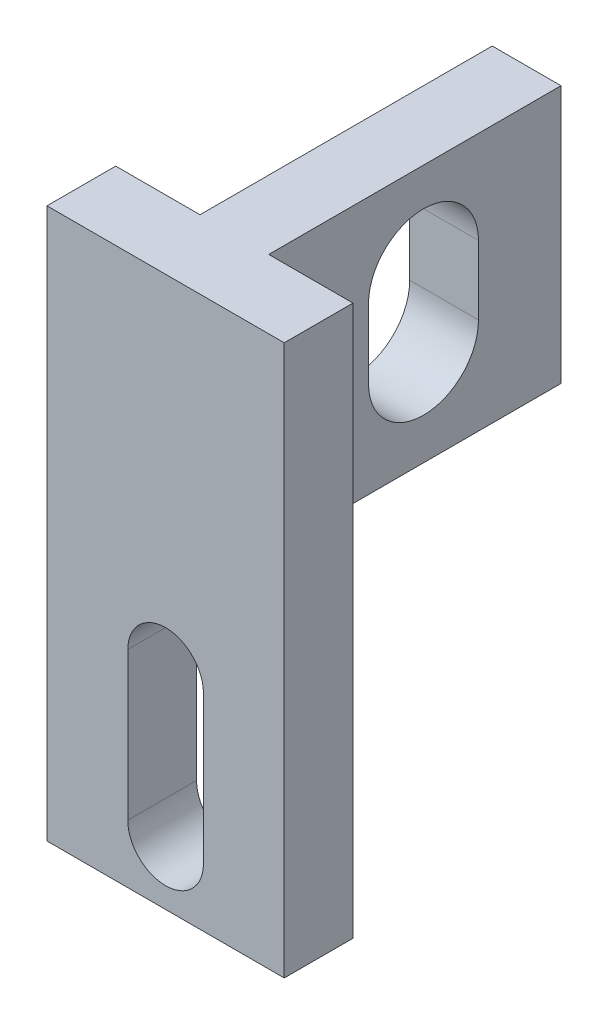
ISO-10303-21;
HEADER;
FILE_DESCRIPTION(('STEP AP214'),'2;1');
FILE_NAME('part.step','',(''),(''),'','','');
FILE_SCHEMA(('AUTOMOTIVE_DESIGN { 1 0 10303 214 1 1 1 1 }'));
ENDSEC;
DATA;
#1=APPLICATION_CONTEXT('core data for automotive mechanical design processes');
#2=APPLICATION_PROTOCOL_DEFINITION('international standard','automotive_design',2000,#1);
#3=PRODUCT_CONTEXT('',#1,'mechanical');
#4=PRODUCT('Part','Part','',(#3));
#5=PRODUCT_RELATED_PRODUCT_CATEGORY('part','',(#4));
#6=PRODUCT_DEFINITION_FORMATION('','',#4);
#7=PRODUCT_DEFINITION_CONTEXT('part definition',#1,'design');
#8=PRODUCT_DEFINITION('design','',#6,#7);
#9=PRODUCT_DEFINITION_SHAPE('','',#8);
#10=(LENGTH_UNIT() NAMED_UNIT(*) SI_UNIT(.MILLI.,.METRE.));
#11=(NAMED_UNIT(*) PLANE_ANGLE_UNIT() SI_UNIT($,.RADIAN.));
#12=(NAMED_UNIT(*) SI_UNIT($,.STERADIAN.) SOLID_ANGLE_UNIT());
#13=UNCERTAINTY_MEASURE_WITH_UNIT(LENGTH_MEASURE(1.E-05),#10,'distance_accuracy_value','');
#14=(GEOMETRIC_REPRESENTATION_CONTEXT(3) GLOBAL_UNCERTAINTY_ASSIGNED_CONTEXT((#13)) GLOBAL_UNIT_ASSIGNED_CONTEXT((#10,
#11,#12)) REPRESENTATION_CONTEXT('',''));
#15=CARTESIAN_POINT('',(0.,0.,0.));
#16=DIRECTION('',(0.,0.,1.));
#17=DIRECTION('',(1.,0.,0.));
#18=AXIS2_PLACEMENT_3D('',#15,#16,#17);
#19=CARTESIAN_POINT('',(-14.9569047042023,11.340209501602,0.));
#20=DIRECTION('',(0.,0.,-1.));
#21=DIRECTION('',(-1.,0.,0.));
#22=AXIS2_PLACEMENT_3D('',#19,#20,#21);
#23=CYLINDRICAL_SURFACE('',#22,1.09999999999999);
#24=DIRECTION('',(0.,0.,-1.));
#25=VECTOR('',#24,1.);
#26=CARTESIAN_POINT('',(-16.0569047042023,11.340209501602,0.));
#27=LINE('',#26,#25);
#28=CARTESIAN_POINT('',(-16.0569047042024,11.340209501602,0.));
#29=VERTEX_POINT('',#28);
#30=CARTESIAN_POINT('',(-16.0569047042024,11.340209501602,2.));
#31=VERTEX_POINT('',#30);
#32=EDGE_CURVE('E12',#29,#31,#27,.F.);
#33=ORIENTED_EDGE('',*,*,#32,.F.);
#34=CARTESIAN_POINT('',(-14.9569047042023,11.340209501602,0.));
#35=DIRECTION('',(0.,0.,-1.));
#36=DIRECTION('',(-1.,0.,0.));
#37=AXIS2_PLACEMENT_3D('',#34,#35,#36);
#38=CIRCLE('',#37,1.09999999999999);
#39=CARTESIAN_POINT('',(-13.8569047042023,11.340209501602,0.));
#40=VERTEX_POINT('',#39);
#41=EDGE_CURVE('E299',#29,#40,#38,.T.);
#42=ORIENTED_EDGE('',*,*,#41,.T.);
#43=DIRECTION('',(0.,0.,-1.));
#44=VECTOR('',#43,1.);
#45=CARTESIAN_POINT('',(-13.8569047042023,11.340209501602,0.));
#46=LINE('',#45,#44);
#47=CARTESIAN_POINT('',(-13.8569047042023,11.340209501602,2.));
#48=VERTEX_POINT('',#47);
#49=EDGE_CURVE('E51',#40,#48,#46,.F.);
#50=ORIENTED_EDGE('',*,*,#49,.T.);
#51=CARTESIAN_POINT('',(-14.9569047042023,11.340209501602,2.));
#52=DIRECTION('',(0.,0.,-1.));
#53=DIRECTION('',(-1.,0.,0.));
#54=AXIS2_PLACEMENT_3D('',#51,#52,#53);
#55=CIRCLE('',#54,1.09999999999999);
#56=EDGE_CURVE('E191',#31,#48,#55,.T.);
#57=ORIENTED_EDGE('',*,*,#56,.F.);
#58=EDGE_LOOP('',(#33,#42,#50,#57));
#59=FACE_BOUND('',#58,.T.);
#60=ADVANCED_FACE('F41',(#59),#23,.F.);
#61=CARTESIAN_POINT('',(-11.4569047042023,21.340209501602,2.));
#62=DIRECTION('',(0.,-1.,0.));
#63=DIRECTION('',(1.,0.,0.));
#64=AXIS2_PLACEMENT_3D('',#61,#62,#63);
#65=PLANE('',#64);
#66=DIRECTION('',(-1.,0.,0.));
#67=VECTOR('',#66,1.);
#68=CARTESIAN_POINT('',(-11.4569047042023,21.340209501602,0.));
#69=LINE('',#68,#67);
#70=CARTESIAN_POINT('',(-15.9569047042023,21.340209501602,0.));
#71=VERTEX_POINT('',#70);
#72=CARTESIAN_POINT('',(-18.4069047042023,21.340209501602,0.));
#73=VERTEX_POINT('',#72);
#74=EDGE_CURVE('E169',#71,#73,#69,.T.);
#75=ORIENTED_EDGE('',*,*,#74,.T.);
#76=DIRECTION('',(0.,0.,-1.));
#77=VECTOR('',#76,1.);
#78=CARTESIAN_POINT('',(-18.4069047042023,21.340209501602,2.));
#79=LINE('',#78,#77);
#80=CARTESIAN_POINT('',(-18.4069047042023,21.340209501602,2.));
#81=VERTEX_POINT('',#80);
#82=EDGE_CURVE('E58',#81,#73,#79,.T.);
#83=ORIENTED_EDGE('',*,*,#82,.F.);
#84=DIRECTION('',(-1.,0.,0.));
#85=VECTOR('',#84,1.);
#86=CARTESIAN_POINT('',(-11.4569047042023,21.340209501602,2.));
#87=LINE('',#86,#85);
#88=CARTESIAN_POINT('',(-11.5069047042023,21.340209501602,2.));
#89=VERTEX_POINT('',#88);
#90=EDGE_CURVE('E167',#89,#81,#87,.T.);
#91=ORIENTED_EDGE('',*,*,#90,.F.);
#92=DIRECTION('',(0.,0.,-1.));
#93=VECTOR('',#92,1.);
#94=CARTESIAN_POINT('',(-11.5069047042023,21.340209501602,2.));
#95=LINE('',#94,#93);
#96=CARTESIAN_POINT('',(-11.5069047042023,21.340209501602,0.));
#97=VERTEX_POINT('',#96);
#98=EDGE_CURVE('E237',#89,#97,#95,.T.);
#99=ORIENTED_EDGE('',*,*,#98,.T.);
#100=CARTESIAN_POINT('',(-13.9569047042023,21.340209501602,0.));
#101=VERTEX_POINT('',#100);
#102=EDGE_CURVE('E45',#97,#101,#69,.T.);
#103=ORIENTED_EDGE('',*,*,#102,.T.);
#104=DIRECTION('',(0.,0.,1.));
#105=VECTOR('',#104,1.);
#106=CARTESIAN_POINT('',(-13.9569047042023,21.340209501602,-8.5));
#107=LINE('',#106,#105);
#108=CARTESIAN_POINT('',(-13.9569047042023,21.340209501602,-8.5));
#109=VERTEX_POINT('',#108);
#110=EDGE_CURVE('E194',#109,#101,#107,.T.);
#111=ORIENTED_EDGE('',*,*,#110,.F.);
#112=DIRECTION('',(1.,0.,0.));
#113=VECTOR('',#112,1.);
#114=CARTESIAN_POINT('',(-13.9569047042023,21.340209501602,-8.5));
#115=LINE('',#114,#113);
#116=CARTESIAN_POINT('',(-15.9569047042023,21.340209501602,-8.5));
#117=VERTEX_POINT('',#116);
#118=EDGE_CURVE('E198',#117,#109,#115,.T.);
#119=ORIENTED_EDGE('',*,*,#118,.F.);
#120=DIRECTION('',(0.,0.,1.));
#121=VECTOR('',#120,1.);
#122=CARTESIAN_POINT('',(-15.9569047042023,21.340209501602,-8.5));
#123=LINE('',#122,#121);
#124=EDGE_CURVE('E197',#117,#71,#123,.T.);
#125=ORIENTED_EDGE('',*,*,#124,.T.);
#126=EDGE_LOOP('',(#75,#83,#91,#99,#103,#111,#119,#125));
#127=FACE_BOUND('',#126,.T.);
#128=ADVANCED_FACE('F43',(#127),#65,.F.);
#129=CARTESIAN_POINT('',(-11.4569047042023,5.34020950160204,2.));
#130=DIRECTION('',(0.,1.,0.));
#131=DIRECTION('',(-1.,0.,0.));
#132=AXIS2_PLACEMENT_3D('',#129,#130,#131);
#133=PLANE('',#132);
#134=DIRECTION('',(1.,0.,0.));
#135=VECTOR('',#134,1.);
#136=CARTESIAN_POINT('',(-11.4569047042023,5.34020950160204,2.));
#137=LINE('',#136,#135);
#138=CARTESIAN_POINT('',(-18.4069047042023,5.34020950160204,2.));
#139=VERTEX_POINT('',#138);
#140=CARTESIAN_POINT('',(-11.5069047042023,5.34020950160204,2.));
#141=VERTEX_POINT('',#140);
#142=EDGE_CURVE('E175',#139,#141,#137,.T.);
#143=ORIENTED_EDGE('',*,*,#142,.F.);
#144=DIRECTION('',(0.,0.,-1.));
#145=VECTOR('',#144,1.);
#146=CARTESIAN_POINT('',(-18.4069047042023,5.34020950160204,2.));
#147=LINE('',#146,#145);
#148=CARTESIAN_POINT('',(-18.4069047042023,5.34020950160204,0.));
#149=VERTEX_POINT('',#148);
#150=EDGE_CURVE('E157',#139,#149,#147,.T.);
#151=ORIENTED_EDGE('',*,*,#150,.T.);
#152=DIRECTION('',(1.,0.,0.));
#153=VECTOR('',#152,1.);
#154=CARTESIAN_POINT('',(-11.4569047042023,5.34020950160204,0.));
#155=LINE('',#154,#153);
#156=CARTESIAN_POINT('',(-11.5069047042023,5.34020950160204,0.));
#157=VERTEX_POINT('',#156);
#158=EDGE_CURVE('E66',#149,#157,#155,.T.);
#159=ORIENTED_EDGE('',*,*,#158,.T.);
#160=DIRECTION('',(0.,0.,-1.));
#161=VECTOR('',#160,1.);
#162=CARTESIAN_POINT('',(-11.5069047042023,5.34020950160204,2.));
#163=LINE('',#162,#161);
#164=EDGE_CURVE('E240',#141,#157,#163,.T.);
#165=ORIENTED_EDGE('',*,*,#164,.F.);
#166=EDGE_LOOP('',(#143,#151,#159,#165));
#167=FACE_BOUND('',#166,.T.);
#168=ADVANCED_FACE('F392',(#167),#133,.F.);
#169=CARTESIAN_POINT('',(0.,0.,2.));
#170=DIRECTION('',(0.,0.,-1.));
#171=DIRECTION('',(-1.,0.,0.));
#172=AXIS2_PLACEMENT_3D('',#169,#170,#171);
#173=PLANE('',#172);
#174=CARTESIAN_POINT('',(-14.9569047042023,7.04020950160204,2.));
#175=DIRECTION('',(0.,0.,-1.));
#176=DIRECTION('',(-1.,0.,0.));
#177=AXIS2_PLACEMENT_3D('',#174,#175,#176);
#178=CIRCLE('',#177,1.10000000000005);
#179=CARTESIAN_POINT('',(-13.8569047042023,7.04020950160204,2.));
#180=VERTEX_POINT('',#179);
#181=CARTESIAN_POINT('',(-16.0569047042024,7.04020950160204,2.));
#182=VERTEX_POINT('',#181);
#183=EDGE_CURVE('E334',#180,#182,#178,.T.);
#184=ORIENTED_EDGE('',*,*,#183,.T.);
#185=DIRECTION('',(0.,1.,0.));
#186=VECTOR('',#185,1.);
#187=CARTESIAN_POINT('',(-16.0569047042024,0.,2.));
#188=LINE('',#187,#186);
#189=EDGE_CURVE('E362',#182,#31,#188,.T.);
#190=ORIENTED_EDGE('',*,*,#189,.T.);
#191=ORIENTED_EDGE('',*,*,#56,.T.);
#192=DIRECTION('',(0.,-1.,0.));
#193=VECTOR('',#192,1.);
#194=CARTESIAN_POINT('',(-13.8569047042023,0.,2.));
#195=LINE('',#194,#193);
#196=EDGE_CURVE('E361',#48,#180,#195,.T.);
#197=ORIENTED_EDGE('',*,*,#196,.T.);
#198=EDGE_LOOP('',(#184,#190,#191,#197));
#199=FACE_BOUND('',#198,.T.);
#200=ORIENTED_EDGE('',*,*,#90,.T.);
#201=DIRECTION('',(0.,-1.,0.));
#202=VECTOR('',#201,1.);
#203=CARTESIAN_POINT('',(-18.4069047042023,21.340209501602,2.));
#204=LINE('',#203,#202);
#205=EDGE_CURVE('E155',#81,#139,#204,.T.);
#206=ORIENTED_EDGE('',*,*,#205,.T.);
#207=ORIENTED_EDGE('',*,*,#142,.T.);
#208=DIRECTION('',(0.,1.,0.));
#209=VECTOR('',#208,1.);
#210=CARTESIAN_POINT('',(-11.5069047042023,21.340209501602,2.));
#211=LINE('',#210,#209);
#212=EDGE_CURVE('E174',#141,#89,#211,.T.);
#213=ORIENTED_EDGE('',*,*,#212,.T.);
#214=EDGE_LOOP('',(#200,#206,#207,#213));
#215=FACE_BOUND('',#214,.T.);
#216=ADVANCED_FACE('F172',(#199,#215),#173,.F.);
#217=CARTESIAN_POINT('',(0.,0.,0.));
#218=DIRECTION('',(0.,0.,-1.));
#219=DIRECTION('',(-1.,0.,0.));
#220=AXIS2_PLACEMENT_3D('',#217,#218,#219);
#221=PLANE('',#220);
#222=DIRECTION('',(0.,-1.,0.));
#223=VECTOR('',#222,1.);
#224=CARTESIAN_POINT('',(-18.4069047042023,21.340209501602,0.));
#225=LINE('',#224,#223);
#226=EDGE_CURVE('E161',#73,#149,#225,.T.);
#227=ORIENTED_EDGE('',*,*,#226,.F.);
#228=ORIENTED_EDGE('',*,*,#74,.F.);
#229=DIRECTION('',(0.,1.,0.));
#230=VECTOR('',#229,1.);
#231=CARTESIAN_POINT('',(-15.9569047042023,21.340209501602,0.));
#232=LINE('',#231,#230);
#233=CARTESIAN_POINT('',(-15.9569047042023,13.840209501602,0.));
#234=VERTEX_POINT('',#233);
#235=EDGE_CURVE('E201',#234,#71,#232,.T.);
#236=ORIENTED_EDGE('',*,*,#235,.F.);
#237=DIRECTION('',(-1.,0.,0.));
#238=VECTOR('',#237,1.);
#239=CARTESIAN_POINT('',(-13.9569047042023,13.840209501602,0.));
#240=LINE('',#239,#238);
#241=CARTESIAN_POINT('',(-13.9569047042023,13.840209501602,0.));
#242=VERTEX_POINT('',#241);
#243=EDGE_CURVE('E190',#242,#234,#240,.T.);
#244=ORIENTED_EDGE('',*,*,#243,.F.);
#245=DIRECTION('',(0.,-1.,0.));
#246=VECTOR('',#245,1.);
#247=CARTESIAN_POINT('',(-13.9569047042023,21.340209501602,0.));
#248=LINE('',#247,#246);
#249=EDGE_CURVE('E187',#101,#242,#248,.T.);
#250=ORIENTED_EDGE('',*,*,#249,.F.);
#251=ORIENTED_EDGE('',*,*,#102,.F.);
#252=DIRECTION('',(0.,1.,0.));
#253=VECTOR('',#252,1.);
#254=CARTESIAN_POINT('',(-11.5069047042023,21.340209501602,0.));
#255=LINE('',#254,#253);
#256=EDGE_CURVE('E236',#157,#97,#255,.T.);
#257=ORIENTED_EDGE('',*,*,#256,.F.);
#258=ORIENTED_EDGE('',*,*,#158,.F.);
#259=EDGE_LOOP('',(#227,#228,#236,#244,#250,#251,#257,#258));
#260=FACE_BOUND('',#259,.T.);
#261=DIRECTION('',(0.,1.,0.));
#262=VECTOR('',#261,1.);
#263=CARTESIAN_POINT('',(-16.0569047042024,7.04020950160204,0.));
#264=LINE('',#263,#262);
#265=CARTESIAN_POINT('',(-16.0569047042024,7.04020950160204,0.));
#266=VERTEX_POINT('',#265);
#267=EDGE_CURVE('E252',#266,#29,#264,.T.);
#268=ORIENTED_EDGE('',*,*,#267,.F.);
#269=CARTESIAN_POINT('',(-14.9569047042023,7.04020950160204,0.));
#270=DIRECTION('',(0.,0.,-1.));
#271=DIRECTION('',(-1.,0.,0.));
#272=AXIS2_PLACEMENT_3D('',#269,#270,#271);
#273=CIRCLE('',#272,1.10000000000005);
#274=CARTESIAN_POINT('',(-13.8569047042023,7.04020950160204,0.));
#275=VERTEX_POINT('',#274);
#276=EDGE_CURVE('E243',#275,#266,#273,.T.);
#277=ORIENTED_EDGE('',*,*,#276,.F.);
#278=DIRECTION('',(0.,-1.,0.));
#279=VECTOR('',#278,1.);
#280=CARTESIAN_POINT('',(-13.8569047042023,7.04020950160204,0.));
#281=LINE('',#280,#279);
#282=EDGE_CURVE('E239',#40,#275,#281,.T.);
#283=ORIENTED_EDGE('',*,*,#282,.F.);
#284=ORIENTED_EDGE('',*,*,#41,.F.);
#285=EDGE_LOOP('',(#268,#277,#283,#284));
#286=FACE_BOUND('',#285,.T.);
#287=ADVANCED_FACE('F223',(#260,#286),#221,.T.);
#288=CARTESIAN_POINT('',(-13.9569047042023,21.340209501602,-8.5));
#289=DIRECTION('',(-1.,0.,0.));
#290=DIRECTION('',(0.,-1.,0.));
#291=AXIS2_PLACEMENT_3D('',#288,#289,#290);
#292=PLANE('',#291);
#293=DIRECTION('',(0.,1.,0.));
#294=VECTOR('',#293,1.);
#295=CARTESIAN_POINT('',(-13.9569047042023,16.640209501602,-6.1));
#296=LINE('',#295,#294);
#297=CARTESIAN_POINT('',(-13.9569047042023,16.640209501602,-6.1));
#298=VERTEX_POINT('',#297);
#299=CARTESIAN_POINT('',(-13.9569047042023,18.640209501602,-6.1));
#300=VERTEX_POINT('',#299);
#301=EDGE_CURVE('E333',#298,#300,#296,.T.);
#302=ORIENTED_EDGE('',*,*,#301,.F.);
#303=CARTESIAN_POINT('',(-13.9569047042023,16.640209501602,-4.5));
#304=DIRECTION('',(1.,0.,0.));
#305=DIRECTION('',(0.,1.,0.));
#306=AXIS2_PLACEMENT_3D('',#303,#304,#305);
#307=CIRCLE('',#306,1.6);
#308=CARTESIAN_POINT('',(-13.9569047042023,16.640209501602,-2.9));
#309=VERTEX_POINT('',#308);
#310=EDGE_CURVE('E329',#309,#298,#307,.T.);
#311=ORIENTED_EDGE('',*,*,#310,.F.);
#312=DIRECTION('',(0.,-1.,0.));
#313=VECTOR('',#312,1.);
#314=CARTESIAN_POINT('',(-13.9569047042023,16.640209501602,-2.9));
#315=LINE('',#314,#313);
#316=CARTESIAN_POINT('',(-13.9569047042023,18.640209501602,-2.9));
#317=VERTEX_POINT('',#316);
#318=EDGE_CURVE('E544',#317,#309,#315,.T.);
#319=ORIENTED_EDGE('',*,*,#318,.F.);
#320=CARTESIAN_POINT('',(-13.9569047042023,18.640209501602,-4.5));
#321=DIRECTION('',(1.,0.,0.));
#322=DIRECTION('',(0.,1.,0.));
#323=AXIS2_PLACEMENT_3D('',#320,#321,#322);
#324=CIRCLE('',#323,1.6);
#325=EDGE_CURVE('E548',#300,#317,#324,.T.);
#326=ORIENTED_EDGE('',*,*,#325,.F.);
#327=EDGE_LOOP('',(#302,#311,#319,#326));
#328=FACE_BOUND('',#327,.T.);
#329=ORIENTED_EDGE('',*,*,#249,.T.);
#330=DIRECTION('',(0.,0.,1.));
#331=VECTOR('',#330,1.);
#332=CARTESIAN_POINT('',(-13.9569047042023,13.840209501602,-8.5));
#333=LINE('',#332,#331);
#334=CARTESIAN_POINT('',(-13.9569047042023,13.840209501602,-8.5));
#335=VERTEX_POINT('',#334);
#336=EDGE_CURVE('E181',#335,#242,#333,.T.);
#337=ORIENTED_EDGE('',*,*,#336,.F.);
#338=DIRECTION('',(0.,-1.,0.));
#339=VECTOR('',#338,1.);
#340=CARTESIAN_POINT('',(-13.9569047042023,21.340209501602,-8.5));
#341=LINE('',#340,#339);
#342=EDGE_CURVE('E205',#109,#335,#341,.T.);
#343=ORIENTED_EDGE('',*,*,#342,.F.);
#344=ORIENTED_EDGE('',*,*,#110,.T.);
#345=EDGE_LOOP('',(#329,#337,#343,#344));
#346=FACE_BOUND('',#345,.T.);
#347=ADVANCED_FACE('F233',(#328,#346),#292,.F.);
#348=CARTESIAN_POINT('',(-13.9569047042023,13.840209501602,-8.5));
#349=DIRECTION('',(0.,1.,0.));
#350=DIRECTION('',(0.,0.,1.));
#351=AXIS2_PLACEMENT_3D('',#348,#349,#350);
#352=PLANE('',#351);
#353=ORIENTED_EDGE('',*,*,#243,.T.);
#354=DIRECTION('',(0.,0.,1.));
#355=VECTOR('',#354,1.);
#356=CARTESIAN_POINT('',(-15.9569047042023,13.840209501602,-8.5));
#357=LINE('',#356,#355);
#358=CARTESIAN_POINT('',(-15.9569047042023,13.840209501602,-8.5));
#359=VERTEX_POINT('',#358);
#360=EDGE_CURVE('E210',#359,#234,#357,.T.);
#361=ORIENTED_EDGE('',*,*,#360,.F.);
#362=DIRECTION('',(-1.,0.,0.));
#363=VECTOR('',#362,1.);
#364=CARTESIAN_POINT('',(-13.9569047042023,13.840209501602,-8.5));
#365=LINE('',#364,#363);
#366=EDGE_CURVE('E229',#335,#359,#365,.T.);
#367=ORIENTED_EDGE('',*,*,#366,.F.);
#368=ORIENTED_EDGE('',*,*,#336,.T.);
#369=EDGE_LOOP('',(#353,#361,#367,#368));
#370=FACE_BOUND('',#369,.T.);
#371=ADVANCED_FACE('F227',(#370),#352,.F.);
#372=CARTESIAN_POINT('',(-15.9569047042023,21.340209501602,-8.5));
#373=DIRECTION('',(1.,0.,0.));
#374=DIRECTION('',(0.,1.,0.));
#375=AXIS2_PLACEMENT_3D('',#372,#373,#374);
#376=PLANE('',#375);
#377=DIRECTION('',(0.,-1.,0.));
#378=VECTOR('',#377,1.);
#379=CARTESIAN_POINT('',(-15.9569047042023,21.340209501602,-2.9));
#380=LINE('',#379,#378);
#381=CARTESIAN_POINT('',(-15.9569047042023,18.640209501602,-2.9));
#382=VERTEX_POINT('',#381);
#383=CARTESIAN_POINT('',(-15.9569047042023,16.640209501602,-2.9));
#384=VERTEX_POINT('',#383);
#385=EDGE_CURVE('E346',#382,#384,#380,.T.);
#386=ORIENTED_EDGE('',*,*,#385,.T.);
#387=CARTESIAN_POINT('',(-15.9569047042023,16.640209501602,-4.5));
#388=DIRECTION('',(1.,0.,0.));
#389=DIRECTION('',(0.,1.,0.));
#390=AXIS2_PLACEMENT_3D('',#387,#388,#389);
#391=CIRCLE('',#390,1.6);
#392=CARTESIAN_POINT('',(-15.9569047042023,16.640209501602,-6.1));
#393=VERTEX_POINT('',#392);
#394=EDGE_CURVE('E341',#384,#393,#391,.T.);
#395=ORIENTED_EDGE('',*,*,#394,.T.);
#396=DIRECTION('',(0.,1.,0.));
#397=VECTOR('',#396,1.);
#398=CARTESIAN_POINT('',(-15.9569047042023,21.340209501602,-6.1));
#399=LINE('',#398,#397);
#400=CARTESIAN_POINT('',(-15.9569047042023,18.640209501602,-6.1));
#401=VERTEX_POINT('',#400);
#402=EDGE_CURVE('E177',#393,#401,#399,.T.);
#403=ORIENTED_EDGE('',*,*,#402,.T.);
#404=CARTESIAN_POINT('',(-15.9569047042023,18.640209501602,-4.5));
#405=DIRECTION('',(1.,0.,0.));
#406=DIRECTION('',(0.,1.,0.));
#407=AXIS2_PLACEMENT_3D('',#404,#405,#406);
#408=CIRCLE('',#407,1.6);
#409=EDGE_CURVE('E556',#401,#382,#408,.T.);
#410=ORIENTED_EDGE('',*,*,#409,.T.);
#411=EDGE_LOOP('',(#386,#395,#403,#410));
#412=FACE_BOUND('',#411,.T.);
#413=ORIENTED_EDGE('',*,*,#235,.T.);
#414=ORIENTED_EDGE('',*,*,#124,.F.);
#415=DIRECTION('',(0.,1.,0.));
#416=VECTOR('',#415,1.);
#417=CARTESIAN_POINT('',(-15.9569047042023,21.340209501602,-8.5));
#418=LINE('',#417,#416);
#419=EDGE_CURVE('E220',#359,#117,#418,.T.);
#420=ORIENTED_EDGE('',*,*,#419,.F.);
#421=ORIENTED_EDGE('',*,*,#360,.T.);
#422=EDGE_LOOP('',(#413,#414,#420,#421));
#423=FACE_BOUND('',#422,.T.);
#424=ADVANCED_FACE('F219',(#412,#423),#376,.F.);
#425=CARTESIAN_POINT('',(0.,0.,-8.5));
#426=DIRECTION('',(0.,0.,-1.));
#427=DIRECTION('',(-1.,0.,0.));
#428=AXIS2_PLACEMENT_3D('',#425,#426,#427);
#429=PLANE('',#428);
#430=ORIENTED_EDGE('',*,*,#342,.T.);
#431=ORIENTED_EDGE('',*,*,#366,.T.);
#432=ORIENTED_EDGE('',*,*,#419,.T.);
#433=ORIENTED_EDGE('',*,*,#118,.T.);
#434=EDGE_LOOP('',(#430,#431,#432,#433));
#435=FACE_BOUND('',#434,.T.);
#436=ADVANCED_FACE('F397',(#435),#429,.T.);
#437=CARTESIAN_POINT('',(-18.4569297042023,16.640209501602,-4.5));
#438=DIRECTION('',(1.,0.,0.));
#439=DIRECTION('',(0.,1.,0.));
#440=AXIS2_PLACEMENT_3D('',#437,#438,#439);
#441=CYLINDRICAL_SURFACE('',#440,1.6);
#442=DIRECTION('',(1.,0.,0.));
#443=VECTOR('',#442,1.);
#444=CARTESIAN_POINT('',(-18.4569297042023,16.640209501602,-2.9));
#445=LINE('',#444,#443);
#446=EDGE_CURVE('E304',#384,#309,#445,.T.);
#447=ORIENTED_EDGE('',*,*,#446,.T.);
#448=ORIENTED_EDGE('',*,*,#310,.T.);
#449=DIRECTION('',(1.,0.,0.));
#450=VECTOR('',#449,1.);
#451=CARTESIAN_POINT('',(-18.4569297042023,16.640209501602,-6.1));
#452=LINE('',#451,#450);
#453=EDGE_CURVE('E305',#393,#298,#452,.T.);
#454=ORIENTED_EDGE('',*,*,#453,.F.);
#455=ORIENTED_EDGE('',*,*,#394,.F.);
#456=EDGE_LOOP('',(#447,#448,#454,#455));
#457=FACE_BOUND('',#456,.T.);
#458=ADVANCED_FACE('F395',(#457),#441,.F.);
#459=CARTESIAN_POINT('',(-18.4569297042023,16.640209501602,-2.9));
#460=DIRECTION('',(0.,0.,1.));
#461=DIRECTION('',(1.,0.,0.));
#462=AXIS2_PLACEMENT_3D('',#459,#460,#461);
#463=PLANE('',#462);
#464=DIRECTION('',(1.,0.,0.));
#465=VECTOR('',#464,1.);
#466=CARTESIAN_POINT('',(-18.4569297042023,18.640209501602,-2.9));
#467=LINE('',#466,#465);
#468=EDGE_CURVE('E565',#382,#317,#467,.T.);
#469=ORIENTED_EDGE('',*,*,#468,.T.);
#470=ORIENTED_EDGE('',*,*,#318,.T.);
#471=ORIENTED_EDGE('',*,*,#446,.F.);
#472=ORIENTED_EDGE('',*,*,#385,.F.);
#473=EDGE_LOOP('',(#469,#470,#471,#472));
#474=FACE_BOUND('',#473,.T.);
#475=ADVANCED_FACE('F450',(#474),#463,.F.);
#476=CARTESIAN_POINT('',(-18.4569297042023,18.640209501602,-4.5));
#477=DIRECTION('',(1.,0.,0.));
#478=DIRECTION('',(0.,1.,0.));
#479=AXIS2_PLACEMENT_3D('',#476,#477,#478);
#480=CYLINDRICAL_SURFACE('',#479,1.6);
#481=DIRECTION('',(1.,0.,0.));
#482=VECTOR('',#481,1.);
#483=CARTESIAN_POINT('',(-18.4569297042023,18.640209501602,-6.1));
#484=LINE('',#483,#482);
#485=EDGE_CURVE('E543',#401,#300,#484,.T.);
#486=ORIENTED_EDGE('',*,*,#485,.T.);
#487=ORIENTED_EDGE('',*,*,#325,.T.);
#488=ORIENTED_EDGE('',*,*,#468,.F.);
#489=ORIENTED_EDGE('',*,*,#409,.F.);
#490=EDGE_LOOP('',(#486,#487,#488,#489));
#491=FACE_BOUND('',#490,.T.);
#492=ADVANCED_FACE('F457',(#491),#480,.F.);
#493=CARTESIAN_POINT('',(-18.4569297042023,16.640209501602,-6.1));
#494=DIRECTION('',(0.,0.,-1.));
#495=DIRECTION('',(-1.,0.,0.));
#496=AXIS2_PLACEMENT_3D('',#493,#494,#495);
#497=PLANE('',#496);
#498=ORIENTED_EDGE('',*,*,#453,.T.);
#499=ORIENTED_EDGE('',*,*,#301,.T.);
#500=ORIENTED_EDGE('',*,*,#485,.F.);
#501=ORIENTED_EDGE('',*,*,#402,.F.);
#502=EDGE_LOOP('',(#498,#499,#500,#501));
#503=FACE_BOUND('',#502,.T.);
#504=ADVANCED_FACE('F464',(#503),#497,.F.);
#505=CARTESIAN_POINT('',(-14.9569047042023,7.04020950160204,10.));
#506=DIRECTION('',(0.,0.,-1.));
#507=DIRECTION('',(-1.,0.,0.));
#508=AXIS2_PLACEMENT_3D('',#505,#506,#507);
#509=CYLINDRICAL_SURFACE('',#508,1.10000000000005);
#510=DIRECTION('',(0.,0.,-1.));
#511=VECTOR('',#510,1.);
#512=CARTESIAN_POINT('',(-13.8569047042023,7.04020950160204,10.));
#513=LINE('',#512,#511);
#514=EDGE_CURVE('E368',#180,#275,#513,.T.);
#515=ORIENTED_EDGE('',*,*,#514,.T.);
#516=ORIENTED_EDGE('',*,*,#276,.T.);
#517=DIRECTION('',(0.,0.,-1.));
#518=VECTOR('',#517,1.);
#519=CARTESIAN_POINT('',(-16.0569047042024,7.04020950160204,10.));
#520=LINE('',#519,#518);
#521=EDGE_CURVE('E365',#182,#266,#520,.T.);
#522=ORIENTED_EDGE('',*,*,#521,.F.);
#523=ORIENTED_EDGE('',*,*,#183,.F.);
#524=EDGE_LOOP('',(#515,#516,#522,#523));
#525=FACE_BOUND('',#524,.T.);
#526=ADVANCED_FACE('F373',(#525),#509,.F.);
#527=CARTESIAN_POINT('',(-16.0569047042024,7.04020950160204,10.));
#528=DIRECTION('',(-1.,0.,0.));
#529=DIRECTION('',(0.,0.,1.));
#530=AXIS2_PLACEMENT_3D('',#527,#528,#529);
#531=PLANE('',#530);
#532=ORIENTED_EDGE('',*,*,#521,.T.);
#533=ORIENTED_EDGE('',*,*,#267,.T.);
#534=ORIENTED_EDGE('',*,*,#32,.T.);
#535=ORIENTED_EDGE('',*,*,#189,.F.);
#536=EDGE_LOOP('',(#532,#533,#534,#535));
#537=FACE_BOUND('',#536,.T.);
#538=ADVANCED_FACE('F369',(#537),#531,.F.);
#539=CARTESIAN_POINT('',(-13.8569047042023,7.04020950160204,10.));
#540=DIRECTION('',(1.,0.,0.));
#541=DIRECTION('',(0.,0.,-1.));
#542=AXIS2_PLACEMENT_3D('',#539,#540,#541);
#543=PLANE('',#542);
#544=ORIENTED_EDGE('',*,*,#49,.F.);
#545=ORIENTED_EDGE('',*,*,#282,.T.);
#546=ORIENTED_EDGE('',*,*,#514,.F.);
#547=ORIENTED_EDGE('',*,*,#196,.F.);
#548=EDGE_LOOP('',(#544,#545,#546,#547));
#549=FACE_BOUND('',#548,.T.);
#550=ADVANCED_FACE('F375',(#549),#543,.F.);
#551=CARTESIAN_POINT('',(-11.5069047042023,21.340209501602,2.));
#552=DIRECTION('',(-1.,0.,0.));
#553=DIRECTION('',(0.,0.,1.));
#554=AXIS2_PLACEMENT_3D('',#551,#552,#553);
#555=PLANE('',#554);
#556=ORIENTED_EDGE('',*,*,#256,.T.);
#557=ORIENTED_EDGE('',*,*,#98,.F.);
#558=ORIENTED_EDGE('',*,*,#212,.F.);
#559=ORIENTED_EDGE('',*,*,#164,.T.);
#560=EDGE_LOOP('',(#556,#557,#558,#559));
#561=FACE_BOUND('',#560,.T.);
#562=ADVANCED_FACE('F377',(#561),#555,.F.);
#563=CARTESIAN_POINT('',(-18.4069047042023,21.340209501602,2.));
#564=DIRECTION('',(1.,0.,0.));
#565=DIRECTION('',(0.,1.,0.));
#566=AXIS2_PLACEMENT_3D('',#563,#564,#565);
#567=PLANE('',#566);
#568=ORIENTED_EDGE('',*,*,#226,.T.);
#569=ORIENTED_EDGE('',*,*,#150,.F.);
#570=ORIENTED_EDGE('',*,*,#205,.F.);
#571=ORIENTED_EDGE('',*,*,#82,.T.);
#572=EDGE_LOOP('',(#568,#569,#570,#571));
#573=FACE_BOUND('',#572,.T.);
#574=ADVANCED_FACE('F156',(#573),#567,.F.);
#575=CLOSED_SHELL('',(#60,#128,#168,#216,#287,#347,#371,#424,#436,#458,#475,#492,#504,#526,#538,
#550,#562,#574));
#576=MANIFOLD_SOLID_BREP('B2',#575);
#577=ADVANCED_BREP_SHAPE_REPRESENTATION('',(#18,#576),#14);
#578=SHAPE_DEFINITION_REPRESENTATION(#9,#577);
ENDSEC;
END-ISO-10303-21;
